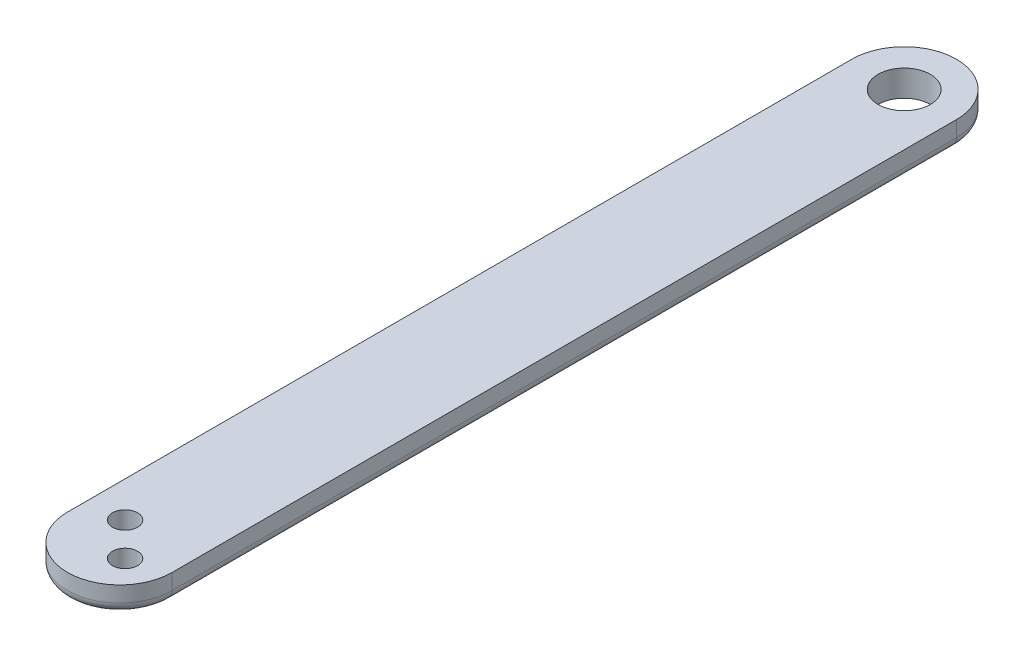
ISO-10303-21;
HEADER;
FILE_DESCRIPTION(('STEP AP214'),'2;1');
FILE_NAME('part.step','',(''),(''),'','','');
FILE_SCHEMA(('AUTOMOTIVE_DESIGN { 1 0 10303 214 1 1 1 1 }'));
ENDSEC;
DATA;
#1=APPLICATION_CONTEXT('core data for automotive mechanical design processes');
#2=APPLICATION_PROTOCOL_DEFINITION('international standard','automotive_design',2000,#1);
#3=PRODUCT_CONTEXT('',#1,'mechanical');
#4=PRODUCT('Part','Part','',(#3));
#5=PRODUCT_RELATED_PRODUCT_CATEGORY('part','',(#4));
#6=PRODUCT_DEFINITION_FORMATION('','',#4);
#7=PRODUCT_DEFINITION_CONTEXT('part definition',#1,'design');
#8=PRODUCT_DEFINITION('design','',#6,#7);
#9=PRODUCT_DEFINITION_SHAPE('','',#8);
#10=(LENGTH_UNIT() NAMED_UNIT(*) SI_UNIT(.MILLI.,.METRE.));
#11=(NAMED_UNIT(*) PLANE_ANGLE_UNIT() SI_UNIT($,.RADIAN.));
#12=(NAMED_UNIT(*) SI_UNIT($,.STERADIAN.) SOLID_ANGLE_UNIT());
#13=UNCERTAINTY_MEASURE_WITH_UNIT(LENGTH_MEASURE(1.E-05),#10,'distance_accuracy_value','');
#14=(GEOMETRIC_REPRESENTATION_CONTEXT(3) GLOBAL_UNCERTAINTY_ASSIGNED_CONTEXT((#13)) GLOBAL_UNIT_ASSIGNED_CONTEXT((#10,
#11,#12)) REPRESENTATION_CONTEXT('',''));
#15=CARTESIAN_POINT('',(0.,0.,0.));
#16=DIRECTION('',(0.,0.,1.));
#17=DIRECTION('',(1.,0.,0.));
#18=AXIS2_PLACEMENT_3D('',#15,#16,#17);
#19=CARTESIAN_POINT('',(-5.,-1.5,0.));
#20=DIRECTION('',(0.,-1.,0.));
#21=DIRECTION('',(0.,0.,-1.));
#22=AXIS2_PLACEMENT_3D('',#19,#20,#21);
#23=PLANE('',#22);
#24=CARTESIAN_POINT('',(-1.59099025766973,-1.5,35.4090097423302));
#25=DIRECTION('',(0.,-1.,0.));
#26=DIRECTION('',(0.,0.,-1.));
#27=AXIS2_PLACEMENT_3D('',#24,#25,#26);
#28=CIRCLE('',#27,1.2);
#29=CARTESIAN_POINT('',(-1.59099025766973,-1.5,34.2090097423302));
#30=VERTEX_POINT('',#29);
#31=EDGE_CURVE('E111',#30,#30,#28,.F.);
#32=ORIENTED_EDGE('',*,*,#31,.F.);
#33=EDGE_LOOP('',(#32));
#34=FACE_BOUND('',#33,.T.);
#35=CARTESIAN_POINT('',(0.,-1.5,37.5));
#36=DIRECTION('',(0.,-1.,0.));
#37=DIRECTION('',(0.,0.,-1.));
#38=AXIS2_PLACEMENT_3D('',#35,#36,#37);
#39=CIRCLE('',#38,4.99999999999998);
#40=CARTESIAN_POINT('',(4.99999999999999,-1.5,37.5));
#41=VERTEX_POINT('',#40);
#42=CARTESIAN_POINT('',(-4.99999999999998,-1.5,37.5));
#43=VERTEX_POINT('',#42);
#44=EDGE_CURVE('E96',#41,#43,#39,.T.);
#45=ORIENTED_EDGE('',*,*,#44,.F.);
#46=DIRECTION('',(0.,0.,-1.));
#47=VECTOR('',#46,1.);
#48=CARTESIAN_POINT('',(4.99999999999545,-1.50000000002137,52.9403065089141));
#49=LINE('',#48,#47);
#50=CARTESIAN_POINT('',(4.99999999999545,-1.50000000002137,-37.5));
#51=VERTEX_POINT('',#50);
#52=EDGE_CURVE('E101',#41,#51,#49,.T.);
#53=ORIENTED_EDGE('',*,*,#52,.T.);
#54=CARTESIAN_POINT('',(0.,-1.50000000002137,-37.5));
#55=DIRECTION('',(0.,-1.,0.));
#56=DIRECTION('',(0.,0.,-1.));
#57=AXIS2_PLACEMENT_3D('',#54,#55,#56);
#58=CIRCLE('',#57,4.99999999999998);
#59=CARTESIAN_POINT('',(-4.99999999999545,-1.50000000002137,-37.5));
#60=VERTEX_POINT('',#59);
#61=EDGE_CURVE('E59',#60,#51,#58,.T.);
#62=ORIENTED_EDGE('',*,*,#61,.F.);
#63=DIRECTION('',(0.,0.,-1.));
#64=VECTOR('',#63,1.);
#65=CARTESIAN_POINT('',(-4.99999999999545,-1.50000000002137,52.9403065089141));
#66=LINE('',#65,#64);
#67=EDGE_CURVE('E93',#43,#60,#66,.T.);
#68=ORIENTED_EDGE('',*,*,#67,.F.);
#69=EDGE_LOOP('',(#45,#53,#62,#68));
#70=FACE_BOUND('',#69,.T.);
#71=CARTESIAN_POINT('',(1.59099025766973,-1.5,38.5909902576697));
#72=DIRECTION('',(0.,-1.,0.));
#73=DIRECTION('',(0.,0.,-1.));
#74=AXIS2_PLACEMENT_3D('',#71,#72,#73);
#75=CIRCLE('',#74,1.2);
#76=CARTESIAN_POINT('',(1.59099025766973,-1.5,37.3909902576697));
#77=VERTEX_POINT('',#76);
#78=EDGE_CURVE('E158',#77,#77,#75,.F.);
#79=ORIENTED_EDGE('',*,*,#78,.F.);
#80=EDGE_LOOP('',(#79));
#81=FACE_BOUND('',#80,.T.);
#82=CARTESIAN_POINT('',(0.,-1.50000000002137,-37.5));
#83=DIRECTION('',(0.,-1.,0.));
#84=DIRECTION('',(0.,0.,-1.));
#85=AXIS2_PLACEMENT_3D('',#82,#83,#84);
#86=CIRCLE('',#85,2.5);
#87=CARTESIAN_POINT('',(0.,-1.50000000002137,-40.));
#88=VERTEX_POINT('',#87);
#89=EDGE_CURVE('E102',#88,#88,#86,.T.);
#90=ORIENTED_EDGE('',*,*,#89,.T.);
#91=EDGE_LOOP('',(#90));
#92=FACE_BOUND('',#91,.T.);
#93=ADVANCED_FACE('F42',(#34,#70,#81,#92),#23,.F.);
#94=CARTESIAN_POINT('',(0.,-4.,-37.5));
#95=DIRECTION('',(0.,1.,0.));
#96=DIRECTION('',(0.,0.,1.));
#97=AXIS2_PLACEMENT_3D('',#94,#95,#96);
#98=PLANE('',#97);
#99=DIRECTION('',(0.,0.,1.));
#100=VECTOR('',#99,1.);
#101=CARTESIAN_POINT('',(-4.,-4.,-37.5));
#102=LINE('',#101,#100);
#103=CARTESIAN_POINT('',(-3.99999999999998,-4.,37.5));
#104=VERTEX_POINT('',#103);
#105=CARTESIAN_POINT('',(-4.,-4.,-37.5));
#106=VERTEX_POINT('',#105);
#107=EDGE_CURVE('E140',#104,#106,#102,.F.);
#108=ORIENTED_EDGE('',*,*,#107,.T.);
#109=CARTESIAN_POINT('',(0.,-4.,-37.5));
#110=DIRECTION('',(0.,1.,0.));
#111=DIRECTION('',(0.,0.,1.));
#112=AXIS2_PLACEMENT_3D('',#109,#110,#111);
#113=CIRCLE('',#112,3.99999999999998);
#114=CARTESIAN_POINT('',(3.99999999999997,-4.,-37.5));
#115=VERTEX_POINT('',#114);
#116=EDGE_CURVE('E146',#106,#115,#113,.F.);
#117=ORIENTED_EDGE('',*,*,#116,.T.);
#118=DIRECTION('',(0.,0.,-1.));
#119=VECTOR('',#118,1.);
#120=CARTESIAN_POINT('',(3.99999999999997,-4.,-37.5));
#121=LINE('',#120,#119);
#122=CARTESIAN_POINT('',(3.99999999999999,-4.,37.5));
#123=VERTEX_POINT('',#122);
#124=EDGE_CURVE('E144',#115,#123,#121,.F.);
#125=ORIENTED_EDGE('',*,*,#124,.T.);
#126=CARTESIAN_POINT('',(0.,-4.,37.5));
#127=DIRECTION('',(0.,1.,0.));
#128=DIRECTION('',(0.,0.,1.));
#129=AXIS2_PLACEMENT_3D('',#126,#127,#128);
#130=CIRCLE('',#129,3.99999999999998);
#131=EDGE_CURVE('E142',#123,#104,#130,.F.);
#132=ORIENTED_EDGE('',*,*,#131,.T.);
#133=EDGE_LOOP('',(#108,#117,#125,#132));
#134=FACE_BOUND('',#133,.T.);
#135=CARTESIAN_POINT('',(-1.59099025766973,-4.,35.4090097423302));
#136=DIRECTION('',(0.,1.,0.));
#137=DIRECTION('',(0.,0.,1.));
#138=AXIS2_PLACEMENT_3D('',#135,#136,#137);
#139=CIRCLE('',#138,1.2);
#140=CARTESIAN_POINT('',(-1.59099025766973,-4.,36.6090097423302));
#141=VERTEX_POINT('',#140);
#142=EDGE_CURVE('E120',#141,#141,#139,.T.);
#143=ORIENTED_EDGE('',*,*,#142,.T.);
#144=EDGE_LOOP('',(#143));
#145=FACE_BOUND('',#144,.T.);
#146=CARTESIAN_POINT('',(1.59099025766973,-4.,38.5909902576697));
#147=DIRECTION('',(0.,1.,0.));
#148=DIRECTION('',(0.,0.,1.));
#149=AXIS2_PLACEMENT_3D('',#146,#147,#148);
#150=CIRCLE('',#149,1.2);
#151=CARTESIAN_POINT('',(1.59099025766973,-4.,39.7909902576697));
#152=VERTEX_POINT('',#151);
#153=EDGE_CURVE('E124',#152,#152,#150,.T.);
#154=ORIENTED_EDGE('',*,*,#153,.T.);
#155=EDGE_LOOP('',(#154));
#156=FACE_BOUND('',#155,.T.);
#157=CARTESIAN_POINT('',(0.,-4.,-37.5));
#158=DIRECTION('',(0.,1.,0.));
#159=DIRECTION('',(0.,0.,1.));
#160=AXIS2_PLACEMENT_3D('',#157,#158,#159);
#161=CIRCLE('',#160,2.5);
#162=CARTESIAN_POINT('',(0.,-4.,-35.));
#163=VERTEX_POINT('',#162);
#164=EDGE_CURVE('E129',#163,#163,#161,.T.);
#165=ORIENTED_EDGE('',*,*,#164,.T.);
#166=EDGE_LOOP('',(#165));
#167=FACE_BOUND('',#166,.T.);
#168=ADVANCED_FACE('F166',(#134,#145,#156,#167),#98,.F.);
#169=CARTESIAN_POINT('',(0.,4.,-37.5));
#170=DIRECTION('',(0.,-1.,0.));
#171=DIRECTION('',(0.,0.,-1.));
#172=AXIS2_PLACEMENT_3D('',#169,#170,#171);
#173=CYLINDRICAL_SURFACE('',#172,2.5);
#174=ORIENTED_EDGE('',*,*,#89,.F.);
#175=EDGE_LOOP('',(#174));
#176=FACE_BOUND('',#175,.T.);
#177=ORIENTED_EDGE('',*,*,#164,.F.);
#178=EDGE_LOOP('',(#177));
#179=FACE_BOUND('',#178,.T.);
#180=ADVANCED_FACE('F171',(#176,#179),#173,.F.);
#181=CARTESIAN_POINT('',(-1.59099025766973,4.,35.4090097423302));
#182=DIRECTION('',(0.,1.,0.));
#183=DIRECTION('',(0.,0.,1.));
#184=AXIS2_PLACEMENT_3D('',#181,#182,#183);
#185=CYLINDRICAL_SURFACE('',#184,1.2);
#186=ORIENTED_EDGE('',*,*,#31,.T.);
#187=EDGE_LOOP('',(#186));
#188=FACE_BOUND('',#187,.T.);
#189=ORIENTED_EDGE('',*,*,#142,.F.);
#190=EDGE_LOOP('',(#189));
#191=FACE_BOUND('',#190,.T.);
#192=ADVANCED_FACE('F174',(#188,#191),#185,.F.);
#193=CARTESIAN_POINT('',(1.59099025766973,4.,38.5909902576697));
#194=DIRECTION('',(0.,1.,0.));
#195=DIRECTION('',(0.,0.,1.));
#196=AXIS2_PLACEMENT_3D('',#193,#194,#195);
#197=CYLINDRICAL_SURFACE('',#196,1.2);
#198=ORIENTED_EDGE('',*,*,#78,.T.);
#199=EDGE_LOOP('',(#198));
#200=FACE_BOUND('',#199,.T.);
#201=ORIENTED_EDGE('',*,*,#153,.F.);
#202=EDGE_LOOP('',(#201));
#203=FACE_BOUND('',#202,.T.);
#204=ADVANCED_FACE('F162',(#200,#203),#197,.F.);
#205=CARTESIAN_POINT('',(0.,-3.,37.5));
#206=DIRECTION('',(0.,1.,0.));
#207=DIRECTION('',(0.,0.,1.));
#208=AXIS2_PLACEMENT_3D('',#205,#206,#207);
#209=TOROIDAL_SURFACE('',#208,3.99999999999998,1.);
#210=CARTESIAN_POINT('',(-3.99999999999998,-3.,37.5));
#211=DIRECTION('',(0.,0.,-1.));
#212=DIRECTION('',(-1.,0.,0.));
#213=AXIS2_PLACEMENT_3D('',#210,#211,#212);
#214=CIRCLE('',#213,1.);
#215=CARTESIAN_POINT('',(-4.99999999999998,-3.,37.5));
#216=VERTEX_POINT('',#215);
#217=EDGE_CURVE('E151',#104,#216,#214,.T.);
#218=ORIENTED_EDGE('',*,*,#217,.F.);
#219=ORIENTED_EDGE('',*,*,#131,.F.);
#220=CARTESIAN_POINT('',(3.99999999999999,-3.,37.5));
#221=DIRECTION('',(0.,0.,-1.));
#222=DIRECTION('',(-1.,0.,0.));
#223=AXIS2_PLACEMENT_3D('',#220,#221,#222);
#224=CIRCLE('',#223,1.);
#225=CARTESIAN_POINT('',(4.99999999999999,-3.,37.5));
#226=VERTEX_POINT('',#225);
#227=EDGE_CURVE('E123',#226,#123,#224,.T.);
#228=ORIENTED_EDGE('',*,*,#227,.F.);
#229=CARTESIAN_POINT('',(0.,-3.,37.5));
#230=DIRECTION('',(0.,1.,0.));
#231=DIRECTION('',(0.,0.,1.));
#232=AXIS2_PLACEMENT_3D('',#229,#230,#231);
#233=CIRCLE('',#232,4.99999999999998);
#234=EDGE_CURVE('E135',#216,#226,#233,.T.);
#235=ORIENTED_EDGE('',*,*,#234,.F.);
#236=EDGE_LOOP('',(#218,#219,#228,#235));
#237=FACE_BOUND('',#236,.T.);
#238=ADVANCED_FACE('F199',(#237),#209,.T.);
#239=CARTESIAN_POINT('',(0.,-3.,-37.5));
#240=DIRECTION('',(0.,1.,0.));
#241=DIRECTION('',(0.,0.,1.));
#242=AXIS2_PLACEMENT_3D('',#239,#240,#241);
#243=TOROIDAL_SURFACE('',#242,3.99999999999998,1.);
#244=CARTESIAN_POINT('',(3.99999999999997,-3.,-37.5));
#245=DIRECTION('',(0.,0.,-1.));
#246=DIRECTION('',(-1.,0.,0.));
#247=AXIS2_PLACEMENT_3D('',#244,#245,#246);
#248=CIRCLE('',#247,1.);
#249=CARTESIAN_POINT('',(4.99999999999997,-3.,-37.5));
#250=VERTEX_POINT('',#249);
#251=EDGE_CURVE('E51',#250,#115,#248,.T.);
#252=ORIENTED_EDGE('',*,*,#251,.T.);
#253=ORIENTED_EDGE('',*,*,#116,.F.);
#254=CARTESIAN_POINT('',(-4.,-3.,-37.5));
#255=DIRECTION('',(0.,0.,-1.));
#256=DIRECTION('',(-1.,0.,0.));
#257=AXIS2_PLACEMENT_3D('',#254,#255,#256);
#258=CIRCLE('',#257,1.);
#259=CARTESIAN_POINT('',(-5.,-3.,-37.5));
#260=VERTEX_POINT('',#259);
#261=EDGE_CURVE('E11',#106,#260,#258,.T.);
#262=ORIENTED_EDGE('',*,*,#261,.T.);
#263=CARTESIAN_POINT('',(0.,-3.,-37.5));
#264=DIRECTION('',(0.,1.,0.));
#265=DIRECTION('',(0.,0.,1.));
#266=AXIS2_PLACEMENT_3D('',#263,#264,#265);
#267=CIRCLE('',#266,4.99999999999998);
#268=EDGE_CURVE('E137',#250,#260,#267,.T.);
#269=ORIENTED_EDGE('',*,*,#268,.F.);
#270=EDGE_LOOP('',(#252,#253,#262,#269));
#271=FACE_BOUND('',#270,.T.);
#272=ADVANCED_FACE('F186',(#271),#243,.T.);
#273=CARTESIAN_POINT('',(-4.,-3.,-37.5));
#274=DIRECTION('',(0.,0.,1.));
#275=DIRECTION('',(1.,0.,0.));
#276=AXIS2_PLACEMENT_3D('',#273,#274,#275);
#277=CYLINDRICAL_SURFACE('',#276,1.);
#278=ORIENTED_EDGE('',*,*,#217,.T.);
#279=DIRECTION('',(0.,0.,1.));
#280=VECTOR('',#279,1.);
#281=CARTESIAN_POINT('',(-5.,-3.,-37.5));
#282=LINE('',#281,#280);
#283=EDGE_CURVE('E110',#260,#216,#282,.T.);
#284=ORIENTED_EDGE('',*,*,#283,.F.);
#285=ORIENTED_EDGE('',*,*,#261,.F.);
#286=ORIENTED_EDGE('',*,*,#107,.F.);
#287=EDGE_LOOP('',(#278,#284,#285,#286));
#288=FACE_BOUND('',#287,.T.);
#289=ADVANCED_FACE('F193',(#288),#277,.T.);
#290=CARTESIAN_POINT('',(0.,4.,-37.5));
#291=DIRECTION('',(0.,-1.,0.));
#292=DIRECTION('',(0.,0.,-1.));
#293=AXIS2_PLACEMENT_3D('',#290,#291,#292);
#294=CYLINDRICAL_SURFACE('',#293,4.99999999999998);
#295=DIRECTION('',(0.,-1.,0.));
#296=VECTOR('',#295,1.);
#297=CARTESIAN_POINT('',(4.99999999999997,4.,-37.5));
#298=LINE('',#297,#296);
#299=EDGE_CURVE('E46',#51,#250,#298,.T.);
#300=ORIENTED_EDGE('',*,*,#299,.T.);
#301=ORIENTED_EDGE('',*,*,#268,.T.);
#302=DIRECTION('',(0.,-1.,0.));
#303=VECTOR('',#302,1.);
#304=CARTESIAN_POINT('',(-5.,4.,-37.5));
#305=LINE('',#304,#303);
#306=EDGE_CURVE('E115',#60,#260,#305,.T.);
#307=ORIENTED_EDGE('',*,*,#306,.F.);
#308=ORIENTED_EDGE('',*,*,#61,.T.);
#309=EDGE_LOOP('',(#300,#301,#307,#308));
#310=FACE_BOUND('',#309,.T.);
#311=ADVANCED_FACE('F189',(#310),#294,.T.);
#312=CARTESIAN_POINT('',(3.99999999999997,-3.,-37.5));
#313=DIRECTION('',(0.,0.,-1.));
#314=DIRECTION('',(-1.,0.,0.));
#315=AXIS2_PLACEMENT_3D('',#312,#313,#314);
#316=CYLINDRICAL_SURFACE('',#315,1.);
#317=ORIENTED_EDGE('',*,*,#227,.T.);
#318=ORIENTED_EDGE('',*,*,#124,.F.);
#319=ORIENTED_EDGE('',*,*,#251,.F.);
#320=DIRECTION('',(0.,0.,-1.));
#321=VECTOR('',#320,1.);
#322=CARTESIAN_POINT('',(4.99999999999997,-3.,-37.5));
#323=LINE('',#322,#321);
#324=EDGE_CURVE('E117',#226,#250,#323,.T.);
#325=ORIENTED_EDGE('',*,*,#324,.F.);
#326=EDGE_LOOP('',(#317,#318,#319,#325));
#327=FACE_BOUND('',#326,.T.);
#328=ADVANCED_FACE('F192',(#327),#316,.T.);
#329=CARTESIAN_POINT('',(0.,4.,37.5));
#330=DIRECTION('',(0.,-1.,0.));
#331=DIRECTION('',(0.,0.,-1.));
#332=AXIS2_PLACEMENT_3D('',#329,#330,#331);
#333=CYLINDRICAL_SURFACE('',#332,4.99999999999998);
#334=DIRECTION('',(0.,-1.,0.));
#335=VECTOR('',#334,1.);
#336=CARTESIAN_POINT('',(4.99999999999999,4.,37.5));
#337=LINE('',#336,#335);
#338=EDGE_CURVE('E109',#41,#226,#337,.T.);
#339=ORIENTED_EDGE('',*,*,#338,.F.);
#340=ORIENTED_EDGE('',*,*,#44,.T.);
#341=DIRECTION('',(0.,-1.,0.));
#342=VECTOR('',#341,1.);
#343=CARTESIAN_POINT('',(-4.99999999999998,4.,37.5));
#344=LINE('',#343,#342);
#345=EDGE_CURVE('E107',#43,#216,#344,.T.);
#346=ORIENTED_EDGE('',*,*,#345,.T.);
#347=ORIENTED_EDGE('',*,*,#234,.T.);
#348=EDGE_LOOP('',(#339,#340,#346,#347));
#349=FACE_BOUND('',#348,.T.);
#350=ADVANCED_FACE('F105',(#349),#333,.T.);
#351=CARTESIAN_POINT('',(4.99999999999997,4.,-37.5));
#352=DIRECTION('',(-1.,0.,0.));
#353=DIRECTION('',(0.,0.,1.));
#354=AXIS2_PLACEMENT_3D('',#351,#352,#353);
#355=PLANE('',#354);
#356=ORIENTED_EDGE('',*,*,#52,.F.);
#357=ORIENTED_EDGE('',*,*,#338,.T.);
#358=ORIENTED_EDGE('',*,*,#324,.T.);
#359=ORIENTED_EDGE('',*,*,#299,.F.);
#360=EDGE_LOOP('',(#356,#357,#358,#359));
#361=FACE_BOUND('',#360,.T.);
#362=ADVANCED_FACE('F201',(#361),#355,.F.);
#363=CARTESIAN_POINT('',(-5.,4.,-37.5));
#364=DIRECTION('',(1.,0.,0.));
#365=DIRECTION('',(0.,0.,-1.));
#366=AXIS2_PLACEMENT_3D('',#363,#364,#365);
#367=PLANE('',#366);
#368=ORIENTED_EDGE('',*,*,#345,.F.);
#369=ORIENTED_EDGE('',*,*,#67,.T.);
#370=ORIENTED_EDGE('',*,*,#306,.T.);
#371=ORIENTED_EDGE('',*,*,#283,.T.);
#372=EDGE_LOOP('',(#368,#369,#370,#371));
#373=FACE_BOUND('',#372,.T.);
#374=ADVANCED_FACE('F44',(#373),#367,.F.);
#375=CLOSED_SHELL('',(#93,#168,#180,#192,#204,#238,#272,#289,#311,#328,#350,#362,#374));
#376=MANIFOLD_SOLID_BREP('B2',#375);
#377=ADVANCED_BREP_SHAPE_REPRESENTATION('',(#18,#376),#14);
#378=SHAPE_DEFINITION_REPRESENTATION(#9,#377);
ENDSEC;
END-ISO-10303-21;
